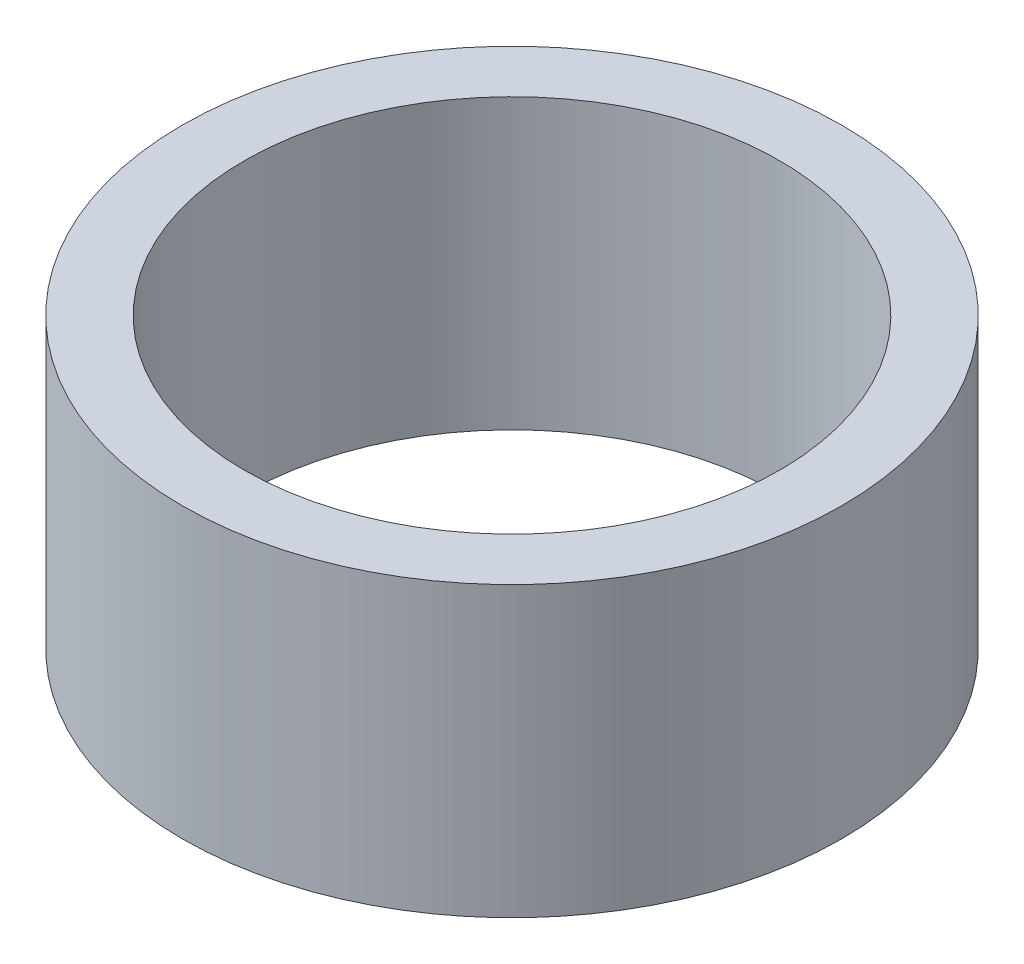
ISO-10303-21;
HEADER;
FILE_DESCRIPTION(('STEP AP214'),'2;1');
FILE_NAME('part.step','',(''),(''),'','','');
FILE_SCHEMA(('AUTOMOTIVE_DESIGN { 1 0 10303 214 1 1 1 1 }'));
ENDSEC;
DATA;
#1=APPLICATION_CONTEXT('core data for automotive mechanical design processes');
#2=APPLICATION_PROTOCOL_DEFINITION('international standard','automotive_design',2000,#1);
#3=PRODUCT_CONTEXT('',#1,'mechanical');
#4=PRODUCT('Part','Part','',(#3));
#5=PRODUCT_RELATED_PRODUCT_CATEGORY('part','',(#4));
#6=PRODUCT_DEFINITION_FORMATION('','',#4);
#7=PRODUCT_DEFINITION_CONTEXT('part definition',#1,'design');
#8=PRODUCT_DEFINITION('design','',#6,#7);
#9=PRODUCT_DEFINITION_SHAPE('','',#8);
#10=(LENGTH_UNIT() NAMED_UNIT(*) SI_UNIT(.MILLI.,.METRE.));
#11=(NAMED_UNIT(*) PLANE_ANGLE_UNIT() SI_UNIT($,.RADIAN.));
#12=(NAMED_UNIT(*) SI_UNIT($,.STERADIAN.) SOLID_ANGLE_UNIT());
#13=UNCERTAINTY_MEASURE_WITH_UNIT(LENGTH_MEASURE(1.E-05),#10,'distance_accuracy_value','');
#14=(GEOMETRIC_REPRESENTATION_CONTEXT(3) GLOBAL_UNCERTAINTY_ASSIGNED_CONTEXT((#13)) GLOBAL_UNIT_ASSIGNED_CONTEXT((#10,
#11,#12)) REPRESENTATION_CONTEXT('',''));
#15=CARTESIAN_POINT('',(0.,0.,0.));
#16=DIRECTION('',(0.,0.,1.));
#17=DIRECTION('',(1.,0.,0.));
#18=AXIS2_PLACEMENT_3D('',#15,#16,#17);
#19=CARTESIAN_POINT('',(0.,14.,0.));
#20=DIRECTION('',(0.,1.,0.));
#21=DIRECTION('',(0.,0.,1.));
#22=AXIS2_PLACEMENT_3D('',#19,#20,#21);
#23=PLANE('',#22);
#24=CARTESIAN_POINT('',(0.,14.,0.));
#25=DIRECTION('',(0.,1.,0.));
#26=DIRECTION('',(1.,0.,0.));
#27=AXIS2_PLACEMENT_3D('',#24,#25,#26);
#28=CIRCLE('',#27,16.);
#29=CARTESIAN_POINT('',(16.,14.,0.));
#30=VERTEX_POINT('',#29);
#31=EDGE_CURVE('E11',#30,#30,#28,.T.);
#32=ORIENTED_EDGE('',*,*,#31,.T.);
#33=EDGE_LOOP('',(#32));
#34=FACE_BOUND('',#33,.T.);
#35=CARTESIAN_POINT('',(0.,14.,0.));
#36=DIRECTION('',(0.,1.,0.));
#37=DIRECTION('',(0.,0.,1.));
#38=AXIS2_PLACEMENT_3D('',#35,#36,#37);
#39=CIRCLE('',#38,13.);
#40=CARTESIAN_POINT('',(0.,14.,13.));
#41=VERTEX_POINT('',#40);
#42=EDGE_CURVE('E49',#41,#41,#39,.T.);
#43=ORIENTED_EDGE('',*,*,#42,.F.);
#44=EDGE_LOOP('',(#43));
#45=FACE_BOUND('',#44,.T.);
#46=ADVANCED_FACE('F38',(#34,#45),#23,.T.);
#47=CARTESIAN_POINT('',(0.,0.,0.));
#48=DIRECTION('',(0.,1.,0.));
#49=DIRECTION('',(0.,0.,1.));
#50=AXIS2_PLACEMENT_3D('',#47,#48,#49);
#51=PLANE('',#50);
#52=CARTESIAN_POINT('',(0.,0.,0.));
#53=DIRECTION('',(0.,1.,0.));
#54=DIRECTION('',(1.,0.,0.));
#55=AXIS2_PLACEMENT_3D('',#52,#53,#54);
#56=CIRCLE('',#55,16.);
#57=CARTESIAN_POINT('',(16.,0.,0.));
#58=VERTEX_POINT('',#57);
#59=EDGE_CURVE('E42',#58,#58,#56,.T.);
#60=ORIENTED_EDGE('',*,*,#59,.F.);
#61=EDGE_LOOP('',(#60));
#62=FACE_BOUND('',#61,.T.);
#63=CARTESIAN_POINT('',(0.,0.,0.));
#64=DIRECTION('',(0.,1.,0.));
#65=DIRECTION('',(0.,0.,1.));
#66=AXIS2_PLACEMENT_3D('',#63,#64,#65);
#67=CIRCLE('',#66,13.);
#68=CARTESIAN_POINT('',(0.,0.,13.));
#69=VERTEX_POINT('',#68);
#70=EDGE_CURVE('E51',#69,#69,#67,.T.);
#71=ORIENTED_EDGE('',*,*,#70,.T.);
#72=EDGE_LOOP('',(#71));
#73=FACE_BOUND('',#72,.T.);
#74=ADVANCED_FACE('F61',(#62,#73),#51,.F.);
#75=CARTESIAN_POINT('',(0.,14.,0.));
#76=DIRECTION('',(0.,-1.,0.));
#77=DIRECTION('',(0.,0.,-1.));
#78=AXIS2_PLACEMENT_3D('',#75,#76,#77);
#79=CYLINDRICAL_SURFACE('',#78,16.);
#80=ORIENTED_EDGE('',*,*,#31,.F.);
#81=EDGE_LOOP('',(#80));
#82=FACE_BOUND('',#81,.T.);
#83=ORIENTED_EDGE('',*,*,#59,.T.);
#84=EDGE_LOOP('',(#83));
#85=FACE_BOUND('',#84,.T.);
#86=ADVANCED_FACE('F40',(#82,#85),#79,.T.);
#87=CARTESIAN_POINT('',(0.,14.,0.));
#88=DIRECTION('',(0.,-1.,0.));
#89=DIRECTION('',(0.,0.,-1.));
#90=AXIS2_PLACEMENT_3D('',#87,#88,#89);
#91=CYLINDRICAL_SURFACE('',#90,13.);
#92=ORIENTED_EDGE('',*,*,#42,.T.);
#93=EDGE_LOOP('',(#92));
#94=FACE_BOUND('',#93,.T.);
#95=ORIENTED_EDGE('',*,*,#70,.F.);
#96=EDGE_LOOP('',(#95));
#97=FACE_BOUND('',#96,.T.);
#98=ADVANCED_FACE('F57',(#94,#97),#91,.F.);
#99=CLOSED_SHELL('',(#46,#74,#86,#98));
#100=MANIFOLD_SOLID_BREP('B2',#99);
#101=ADVANCED_BREP_SHAPE_REPRESENTATION('',(#18,#100),#14);
#102=SHAPE_DEFINITION_REPRESENTATION(#9,#101);
ENDSEC;
END-ISO-10303-21;
